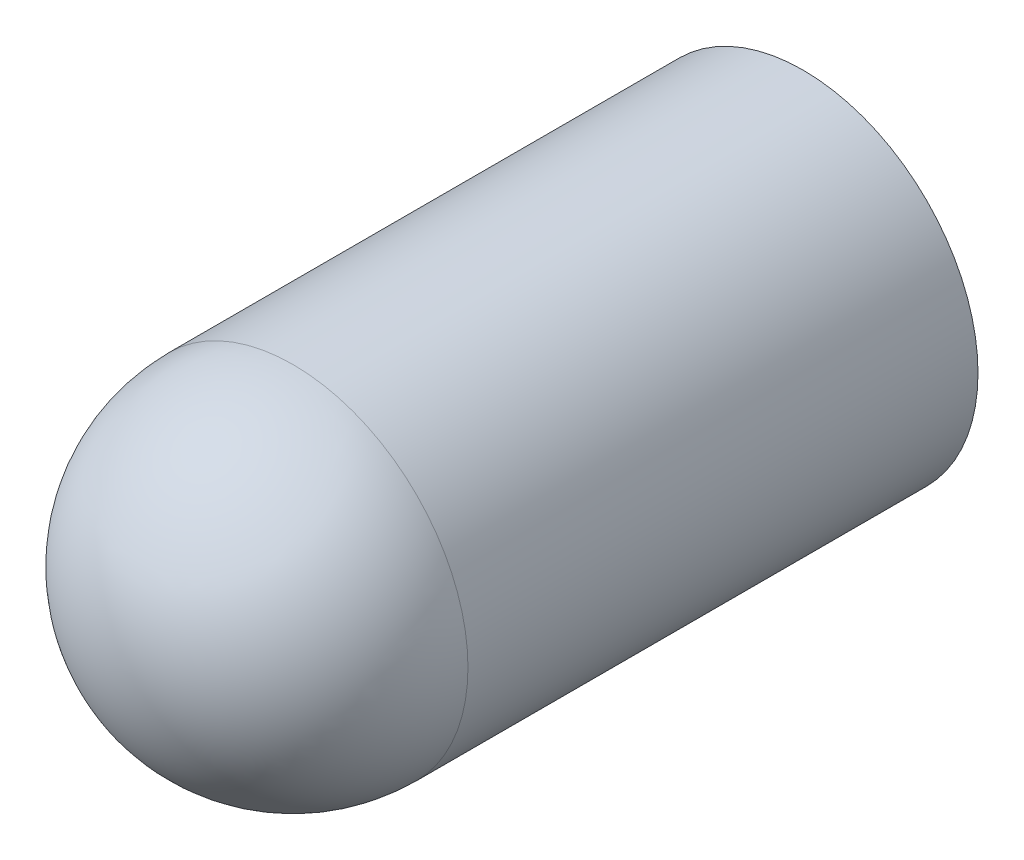
ISO-10303-21;
HEADER;
FILE_DESCRIPTION(('STEP AP214'),'2;1');
FILE_NAME('part.step','',(''),(''),'','','');
FILE_SCHEMA(('AUTOMOTIVE_DESIGN { 1 0 10303 214 1 1 1 1 }'));
ENDSEC;
DATA;
#1=APPLICATION_CONTEXT('core data for automotive mechanical design processes');
#2=APPLICATION_PROTOCOL_DEFINITION('international standard','automotive_design',2000,#1);
#3=PRODUCT_CONTEXT('',#1,'mechanical');
#4=PRODUCT('Part','Part','',(#3));
#5=PRODUCT_RELATED_PRODUCT_CATEGORY('part','',(#4));
#6=PRODUCT_DEFINITION_FORMATION('','',#4);
#7=PRODUCT_DEFINITION_CONTEXT('part definition',#1,'design');
#8=PRODUCT_DEFINITION('design','',#6,#7);
#9=PRODUCT_DEFINITION_SHAPE('','',#8);
#10=(LENGTH_UNIT() NAMED_UNIT(*) SI_UNIT(.MILLI.,.METRE.));
#11=(NAMED_UNIT(*) PLANE_ANGLE_UNIT() SI_UNIT($,.RADIAN.));
#12=(NAMED_UNIT(*) SI_UNIT($,.STERADIAN.) SOLID_ANGLE_UNIT());
#13=UNCERTAINTY_MEASURE_WITH_UNIT(LENGTH_MEASURE(1.E-05),#10,'distance_accuracy_value','');
#14=(GEOMETRIC_REPRESENTATION_CONTEXT(3) GLOBAL_UNCERTAINTY_ASSIGNED_CONTEXT((#13)) GLOBAL_UNIT_ASSIGNED_CONTEXT((#10,
#11,#12)) REPRESENTATION_CONTEXT('',''));
#15=CARTESIAN_POINT('',(0.,0.,0.));
#16=DIRECTION('',(0.,0.,1.));
#17=DIRECTION('',(1.,0.,0.));
#18=AXIS2_PLACEMENT_3D('',#15,#16,#17);
#19=CARTESIAN_POINT('',(0.,0.,35.));
#20=DIRECTION('',(0.,0.,-1.));
#21=DIRECTION('',(-1.,0.,0.));
#22=AXIS2_PLACEMENT_3D('',#19,#20,#21);
#23=CYLINDRICAL_SURFACE('',#22,12.);
#24=CARTESIAN_POINT('',(0.,0.,35.));
#25=DIRECTION('',(0.,0.,1.));
#26=DIRECTION('',(1.,0.,0.));
#27=AXIS2_PLACEMENT_3D('',#24,#25,#26);
#28=CIRCLE('',#27,12.);
#29=CARTESIAN_POINT('',(12.,0.,35.));
#30=VERTEX_POINT('',#29);
#31=EDGE_CURVE('E57',#30,#30,#28,.T.);
#32=ORIENTED_EDGE('',*,*,#31,.F.);
#33=EDGE_LOOP('',(#32));
#34=FACE_BOUND('',#33,.T.);
#35=CARTESIAN_POINT('',(0.,0.,0.));
#36=DIRECTION('',(0.,0.,1.));
#37=DIRECTION('',(1.,0.,0.));
#38=AXIS2_PLACEMENT_3D('',#35,#36,#37);
#39=CIRCLE('',#38,12.);
#40=CARTESIAN_POINT('',(12.,0.,0.));
#41=VERTEX_POINT('',#40);
#42=EDGE_CURVE('E62',#41,#41,#39,.T.);
#43=ORIENTED_EDGE('',*,*,#42,.T.);
#44=EDGE_LOOP('',(#43));
#45=FACE_BOUND('',#44,.T.);
#46=ADVANCED_FACE('F43',(#34,#45),#23,.T.);
#47=CARTESIAN_POINT('',(0.,0.,35.));
#48=DIRECTION('',(0.,0.,1.));
#49=DIRECTION('',(1.,0.,0.));
#50=AXIS2_PLACEMENT_3D('',#47,#48,#49);
#51=SPHERICAL_SURFACE('',#50,12.);
#52=ORIENTED_EDGE('',*,*,#31,.T.);
#53=EDGE_LOOP('',(#52));
#54=FACE_BOUND('',#53,.T.);
#55=ADVANCED_FACE('F70',(#54),#51,.T.);
#56=CARTESIAN_POINT('',(0.,0.,0.));
#57=DIRECTION('',(0.,0.,1.));
#58=DIRECTION('',(1.,0.,0.));
#59=AXIS2_PLACEMENT_3D('',#56,#57,#58);
#60=PLANE('',#59);
#61=ORIENTED_EDGE('',*,*,#42,.F.);
#62=EDGE_LOOP('',(#61));
#63=FACE_BOUND('',#62,.T.);
#64=ADVANCED_FACE('F68',(#63),#60,.F.);
#65=CLOSED_SHELL('',(#46,#55,#64));
#66=CARTESIAN_POINT('',(0.,0.,35.));
#67=DIRECTION('',(0.,0.,-1.));
#68=DIRECTION('',(-1.,0.,0.));
#69=AXIS2_PLACEMENT_3D('',#66,#67,#68);
#70=CYLINDRICAL_SURFACE('',#69,10.5);
#71=CARTESIAN_POINT('',(0.,0.,35.));
#72=DIRECTION('',(0.,0.,1.));
#73=DIRECTION('',(1.,0.,0.));
#74=AXIS2_PLACEMENT_3D('',#71,#72,#73);
#75=CIRCLE('',#74,10.5);
#76=CARTESIAN_POINT('',(10.5,0.,35.));
#77=VERTEX_POINT('',#76);
#78=EDGE_CURVE('E10',#77,#77,#75,.T.);
#79=ORIENTED_EDGE('',*,*,#78,.T.);
#80=EDGE_LOOP('',(#79));
#81=FACE_BOUND('',#80,.T.);
#82=CARTESIAN_POINT('',(0.,0.,1.5));
#83=DIRECTION('',(0.,0.,1.));
#84=DIRECTION('',(1.,0.,0.));
#85=AXIS2_PLACEMENT_3D('',#82,#83,#84);
#86=CIRCLE('',#85,10.5);
#87=CARTESIAN_POINT('',(10.5,0.,1.5));
#88=VERTEX_POINT('',#87);
#89=EDGE_CURVE('E47',#88,#88,#86,.T.);
#90=ORIENTED_EDGE('',*,*,#89,.F.);
#91=EDGE_LOOP('',(#90));
#92=FACE_BOUND('',#91,.T.);
#93=ADVANCED_FACE('F85',(#81,#92),#70,.F.);
#94=CARTESIAN_POINT('',(0.,0.,35.));
#95=DIRECTION('',(0.,0.,1.));
#96=DIRECTION('',(1.,0.,0.));
#97=AXIS2_PLACEMENT_3D('',#94,#95,#96);
#98=SPHERICAL_SURFACE('',#97,10.5);
#99=ORIENTED_EDGE('',*,*,#78,.F.);
#100=EDGE_LOOP('',(#99));
#101=FACE_BOUND('',#100,.T.);
#102=ADVANCED_FACE('F86',(#101),#98,.F.);
#103=CARTESIAN_POINT('',(0.,0.,1.5));
#104=DIRECTION('',(0.,0.,1.));
#105=DIRECTION('',(1.,0.,0.));
#106=AXIS2_PLACEMENT_3D('',#103,#104,#105);
#107=PLANE('',#106);
#108=ORIENTED_EDGE('',*,*,#89,.T.);
#109=EDGE_LOOP('',(#108));
#110=FACE_BOUND('',#109,.T.);
#111=ADVANCED_FACE('F45',(#110),#107,.T.);
#112=CLOSED_SHELL('',(#93,#102,#111));
#113=ORIENTED_CLOSED_SHELL('',*,#112,.T.);
#114=BREP_WITH_VOIDS('B2',#65,(#113));
#115=ADVANCED_BREP_SHAPE_REPRESENTATION('',(#18,#114),#14);
#116=SHAPE_DEFINITION_REPRESENTATION(#9,#115);
ENDSEC;
END-ISO-10303-21;
